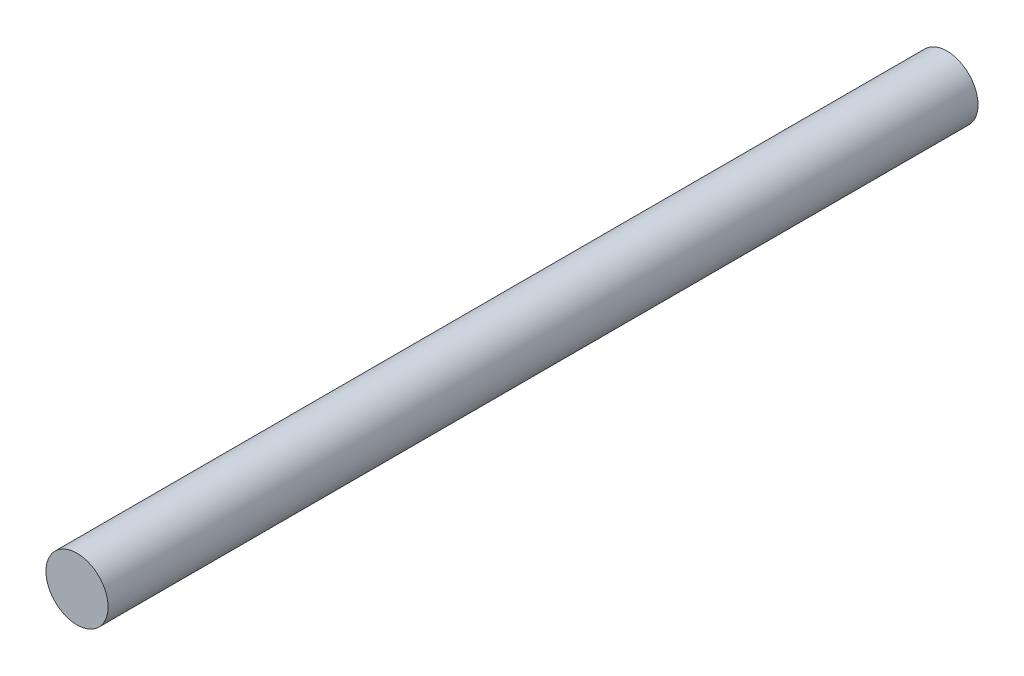
ISO-10303-21;
HEADER;
FILE_DESCRIPTION(('STEP AP214'),'2;1');
FILE_NAME('part.step','',(''),(''),'','','');
FILE_SCHEMA(('AUTOMOTIVE_DESIGN { 1 0 10303 214 1 1 1 1 }'));
ENDSEC;
DATA;
#1=APPLICATION_CONTEXT('core data for automotive mechanical design processes');
#2=APPLICATION_PROTOCOL_DEFINITION('international standard','automotive_design',2000,#1);
#3=PRODUCT_CONTEXT('',#1,'mechanical');
#4=PRODUCT('Part','Part','',(#3));
#5=PRODUCT_RELATED_PRODUCT_CATEGORY('part','',(#4));
#6=PRODUCT_DEFINITION_FORMATION('','',#4);
#7=PRODUCT_DEFINITION_CONTEXT('part definition',#1,'design');
#8=PRODUCT_DEFINITION('design','',#6,#7);
#9=PRODUCT_DEFINITION_SHAPE('','',#8);
#10=(LENGTH_UNIT() NAMED_UNIT(*) SI_UNIT(.MILLI.,.METRE.));
#11=(NAMED_UNIT(*) PLANE_ANGLE_UNIT() SI_UNIT($,.RADIAN.));
#12=(NAMED_UNIT(*) SI_UNIT($,.STERADIAN.) SOLID_ANGLE_UNIT());
#13=UNCERTAINTY_MEASURE_WITH_UNIT(LENGTH_MEASURE(1.E-05),#10,'distance_accuracy_value','');
#14=(GEOMETRIC_REPRESENTATION_CONTEXT(3) GLOBAL_UNCERTAINTY_ASSIGNED_CONTEXT((#13)) GLOBAL_UNIT_ASSIGNED_CONTEXT((#10,
#11,#12)) REPRESENTATION_CONTEXT('',''));
#15=CARTESIAN_POINT('',(0.,0.,0.));
#16=DIRECTION('',(0.,0.,1.));
#17=DIRECTION('',(1.,0.,0.));
#18=AXIS2_PLACEMENT_3D('',#15,#16,#17);
#19=CARTESIAN_POINT('',(0.,0.,355.6));
#20=DIRECTION('',(0.,0.,-1.));
#21=DIRECTION('',(-1.,0.,0.));
#22=AXIS2_PLACEMENT_3D('',#19,#20,#21);
#23=CYLINDRICAL_SURFACE('',#22,12.7);
#24=CARTESIAN_POINT('',(0.,0.,355.6));
#25=DIRECTION('',(0.,0.,1.));
#26=DIRECTION('',(1.,0.,0.));
#27=AXIS2_PLACEMENT_3D('',#24,#25,#26);
#28=CIRCLE('',#27,12.7);
#29=CARTESIAN_POINT('',(12.7,0.,355.6));
#30=VERTEX_POINT('',#29);
#31=EDGE_CURVE('E10',#30,#30,#28,.T.);
#32=ORIENTED_EDGE('',*,*,#31,.F.);
#33=EDGE_LOOP('',(#32));
#34=FACE_BOUND('',#33,.T.);
#35=CARTESIAN_POINT('',(0.,0.,0.));
#36=DIRECTION('',(0.,0.,1.));
#37=DIRECTION('',(1.,0.,0.));
#38=AXIS2_PLACEMENT_3D('',#35,#36,#37);
#39=CIRCLE('',#38,12.7);
#40=CARTESIAN_POINT('',(12.7,0.,0.));
#41=VERTEX_POINT('',#40);
#42=EDGE_CURVE('E40',#41,#41,#39,.T.);
#43=ORIENTED_EDGE('',*,*,#42,.T.);
#44=EDGE_LOOP('',(#43));
#45=FACE_BOUND('',#44,.T.);
#46=ADVANCED_FACE('F37',(#34,#45),#23,.T.);
#47=CARTESIAN_POINT('',(0.,0.,355.6));
#48=DIRECTION('',(0.,0.,1.));
#49=DIRECTION('',(1.,0.,0.));
#50=AXIS2_PLACEMENT_3D('',#47,#48,#49);
#51=PLANE('',#50);
#52=ORIENTED_EDGE('',*,*,#31,.T.);
#53=EDGE_LOOP('',(#52));
#54=FACE_BOUND('',#53,.T.);
#55=ADVANCED_FACE('F54',(#54),#51,.T.);
#56=CARTESIAN_POINT('',(0.,0.,0.));
#57=DIRECTION('',(0.,0.,1.));
#58=DIRECTION('',(1.,0.,0.));
#59=AXIS2_PLACEMENT_3D('',#56,#57,#58);
#60=PLANE('',#59);
#61=ORIENTED_EDGE('',*,*,#42,.F.);
#62=EDGE_LOOP('',(#61));
#63=FACE_BOUND('',#62,.T.);
#64=ADVANCED_FACE('F52',(#63),#60,.F.);
#65=CLOSED_SHELL('',(#46,#55,#64));
#66=MANIFOLD_SOLID_BREP('B2',#65);
#67=ADVANCED_BREP_SHAPE_REPRESENTATION('',(#18,#66),#14);
#68=SHAPE_DEFINITION_REPRESENTATION(#9,#67);
ENDSEC;
END-ISO-10303-21;
